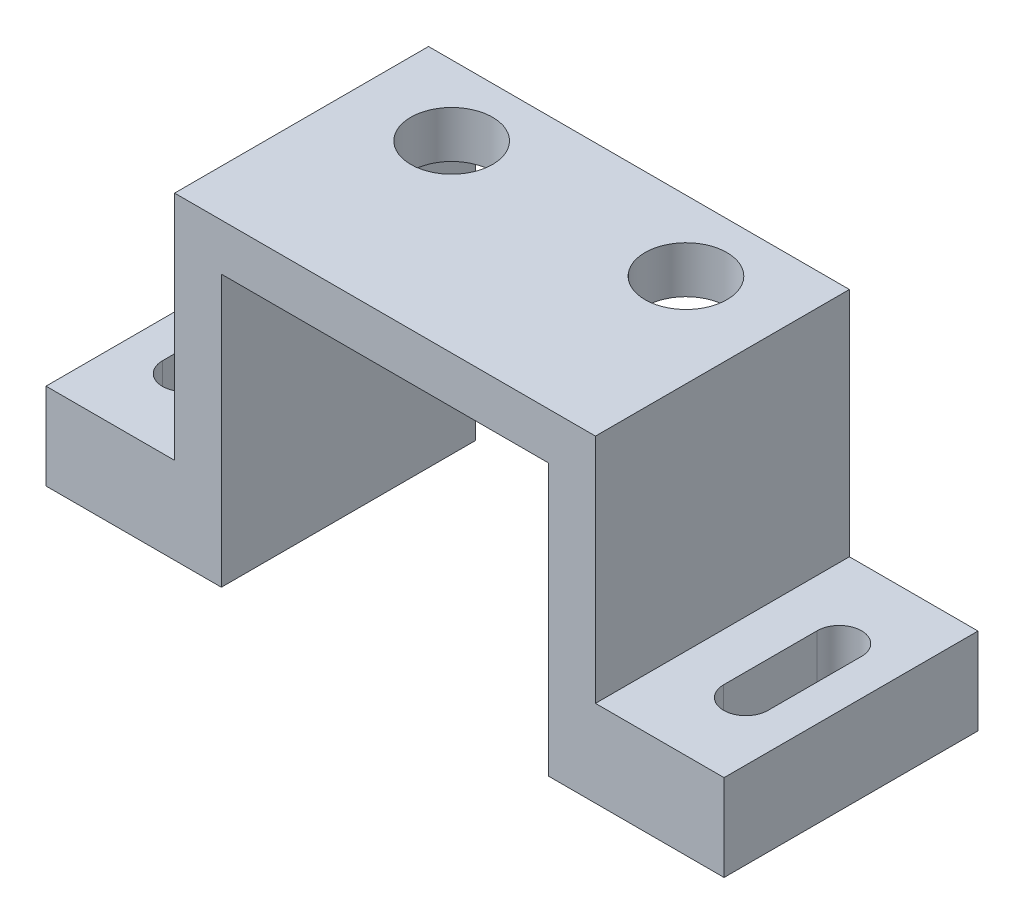
ISO-10303-21;
HEADER;
FILE_DESCRIPTION(('STEP AP214'),'2;1');
FILE_NAME('part.step','',(''),(''),'','','');
FILE_SCHEMA(('AUTOMOTIVE_DESIGN { 1 0 10303 214 1 1 1 1 }'));
ENDSEC;
DATA;
#1=APPLICATION_CONTEXT('core data for automotive mechanical design processes');
#2=APPLICATION_PROTOCOL_DEFINITION('international standard','automotive_design',2000,#1);
#3=PRODUCT_CONTEXT('',#1,'mechanical');
#4=PRODUCT('Part','Part','',(#3));
#5=PRODUCT_RELATED_PRODUCT_CATEGORY('part','',(#4));
#6=PRODUCT_DEFINITION_FORMATION('','',#4);
#7=PRODUCT_DEFINITION_CONTEXT('part definition',#1,'design');
#8=PRODUCT_DEFINITION('design','',#6,#7);
#9=PRODUCT_DEFINITION_SHAPE('','',#8);
#10=(LENGTH_UNIT() NAMED_UNIT(*) SI_UNIT(.MILLI.,.METRE.));
#11=(NAMED_UNIT(*) PLANE_ANGLE_UNIT() SI_UNIT($,.RADIAN.));
#12=(NAMED_UNIT(*) SI_UNIT($,.STERADIAN.) SOLID_ANGLE_UNIT());
#13=UNCERTAINTY_MEASURE_WITH_UNIT(LENGTH_MEASURE(1.E-05),#10,'distance_accuracy_value','');
#14=(GEOMETRIC_REPRESENTATION_CONTEXT(3) GLOBAL_UNCERTAINTY_ASSIGNED_CONTEXT((#13)) GLOBAL_UNIT_ASSIGNED_CONTEXT((#10,
#11,#12)) REPRESENTATION_CONTEXT('',''));
#15=CARTESIAN_POINT('',(0.,0.,0.));
#16=DIRECTION('',(0.,0.,1.));
#17=DIRECTION('',(1.,0.,0.));
#18=AXIS2_PLACEMENT_3D('',#15,#16,#17);
#19=CARTESIAN_POINT('',(0.,-11.6,0.));
#20=DIRECTION('',(0.,-1.,0.));
#21=DIRECTION('',(0.,0.,-1.));
#22=AXIS2_PLACEMENT_3D('',#19,#20,#21);
#23=PLANE('',#22);
#24=DIRECTION('',(-1.,0.,0.));
#25=VECTOR('',#24,1.);
#26=CARTESIAN_POINT('',(9.,-11.6,-3.));
#27=LINE('',#26,#25);
#28=CARTESIAN_POINT('',(14.5,-11.6,-3.));
#29=VERTEX_POINT('',#28);
#30=CARTESIAN_POINT('',(7.,-11.6,-3.));
#31=VERTEX_POINT('',#30);
#32=EDGE_CURVE('E228',#29,#31,#27,.T.);
#33=ORIENTED_EDGE('',*,*,#32,.F.);
#34=DIRECTION('',(0.,0.,1.));
#35=VECTOR('',#34,1.);
#36=CARTESIAN_POINT('',(14.5,-11.6,-3.));
#37=LINE('',#36,#35);
#38=CARTESIAN_POINT('',(14.5,-11.6,7.86));
#39=VERTEX_POINT('',#38);
#40=EDGE_CURVE('E213',#29,#39,#37,.T.);
#41=ORIENTED_EDGE('',*,*,#40,.T.);
#42=DIRECTION('',(1.,0.,0.));
#43=VECTOR('',#42,1.);
#44=CARTESIAN_POINT('',(9.,-11.6,7.86));
#45=LINE('',#44,#43);
#46=CARTESIAN_POINT('',(7.,-11.6,7.86));
#47=VERTEX_POINT('',#46);
#48=EDGE_CURVE('E223',#47,#39,#45,.T.);
#49=ORIENTED_EDGE('',*,*,#48,.F.);
#50=DIRECTION('',(0.,0.,1.));
#51=VECTOR('',#50,1.);
#52=CARTESIAN_POINT('',(7.,-11.6,7.86));
#53=LINE('',#52,#51);
#54=EDGE_CURVE('E225',#31,#47,#53,.T.);
#55=ORIENTED_EDGE('',*,*,#54,.F.);
#56=EDGE_LOOP('',(#33,#41,#49,#55));
#57=FACE_BOUND('',#56,.T.);
#58=DIRECTION('',(0.,0.,1.));
#59=VECTOR('',#58,1.);
#60=CARTESIAN_POINT('',(12.95,-11.6,0.43));
#61=LINE('',#60,#59);
#62=CARTESIAN_POINT('',(12.95,-11.6,0.43));
#63=VERTEX_POINT('',#62);
#64=CARTESIAN_POINT('',(12.95,-11.6,4.43));
#65=VERTEX_POINT('',#64);
#66=EDGE_CURVE('E182',#63,#65,#61,.T.);
#67=ORIENTED_EDGE('',*,*,#66,.F.);
#68=CARTESIAN_POINT('',(12.,-11.6,0.43));
#69=DIRECTION('',(0.,-1.,0.));
#70=DIRECTION('',(0.,0.,1.));
#71=AXIS2_PLACEMENT_3D('',#68,#69,#70);
#72=CIRCLE('',#71,0.95);
#73=CARTESIAN_POINT('',(11.05,-11.6,0.43));
#74=VERTEX_POINT('',#73);
#75=EDGE_CURVE('E178',#74,#63,#72,.T.);
#76=ORIENTED_EDGE('',*,*,#75,.F.);
#77=DIRECTION('',(0.,0.,-1.));
#78=VECTOR('',#77,1.);
#79=CARTESIAN_POINT('',(11.05,-11.6,0.43));
#80=LINE('',#79,#78);
#81=CARTESIAN_POINT('',(11.05,-11.6,4.43));
#82=VERTEX_POINT('',#81);
#83=EDGE_CURVE('E170',#82,#74,#80,.T.);
#84=ORIENTED_EDGE('',*,*,#83,.F.);
#85=CARTESIAN_POINT('',(12.,-11.6,4.43));
#86=DIRECTION('',(0.,-1.,0.));
#87=DIRECTION('',(0.,0.,1.));
#88=AXIS2_PLACEMENT_3D('',#85,#86,#87);
#89=CIRCLE('',#88,0.950000000000001);
#90=EDGE_CURVE('E177',#65,#82,#89,.T.);
#91=ORIENTED_EDGE('',*,*,#90,.F.);
#92=EDGE_LOOP('',(#67,#76,#84,#91));
#93=FACE_BOUND('',#92,.T.);
#94=ADVANCED_FACE('F33',(#57,#93),#23,.T.);
#95=CARTESIAN_POINT('',(14.5,-7.9,-3.));
#96=DIRECTION('',(0.,1.,0.));
#97=DIRECTION('',(0.,0.,1.));
#98=AXIS2_PLACEMENT_3D('',#95,#96,#97);
#99=PLANE('',#98);
#100=DIRECTION('',(0.,0.,-1.));
#101=VECTOR('',#100,1.);
#102=CARTESIAN_POINT('',(9.,-7.9,-3.));
#103=LINE('',#102,#101);
#104=CARTESIAN_POINT('',(9.,-7.9,7.86));
#105=VERTEX_POINT('',#104);
#106=CARTESIAN_POINT('',(9.,-7.9,-3.));
#107=VERTEX_POINT('',#106);
#108=EDGE_CURVE('E200',#105,#107,#103,.T.);
#109=ORIENTED_EDGE('',*,*,#108,.F.);
#110=DIRECTION('',(-1.,0.,0.));
#111=VECTOR('',#110,1.);
#112=CARTESIAN_POINT('',(14.5,-7.9,7.86));
#113=LINE('',#112,#111);
#114=CARTESIAN_POINT('',(14.5,-7.9,7.86));
#115=VERTEX_POINT('',#114);
#116=EDGE_CURVE('E216',#115,#105,#113,.T.);
#117=ORIENTED_EDGE('',*,*,#116,.F.);
#118=DIRECTION('',(0.,0.,-1.));
#119=VECTOR('',#118,1.);
#120=CARTESIAN_POINT('',(14.5,-7.9,-3.));
#121=LINE('',#120,#119);
#122=CARTESIAN_POINT('',(14.5,-7.9,-3.));
#123=VERTEX_POINT('',#122);
#124=EDGE_CURVE('E207',#115,#123,#121,.T.);
#125=ORIENTED_EDGE('',*,*,#124,.T.);
#126=DIRECTION('',(-1.,0.,0.));
#127=VECTOR('',#126,1.);
#128=CARTESIAN_POINT('',(14.5,-7.9,-3.));
#129=LINE('',#128,#127);
#130=EDGE_CURVE('E220',#123,#107,#129,.T.);
#131=ORIENTED_EDGE('',*,*,#130,.T.);
#132=EDGE_LOOP('',(#109,#117,#125,#131));
#133=FACE_BOUND('',#132,.T.);
#134=DIRECTION('',(0.,0.,-1.));
#135=VECTOR('',#134,1.);
#136=CARTESIAN_POINT('',(11.05,-7.9,0.43));
#137=LINE('',#136,#135);
#138=CARTESIAN_POINT('',(11.05,-7.9,4.43));
#139=VERTEX_POINT('',#138);
#140=CARTESIAN_POINT('',(11.05,-7.9,0.430000000000001));
#141=VERTEX_POINT('',#140);
#142=EDGE_CURVE('E194',#139,#141,#137,.T.);
#143=ORIENTED_EDGE('',*,*,#142,.T.);
#144=CARTESIAN_POINT('',(12.,-7.9,0.43));
#145=DIRECTION('',(0.,-1.,0.));
#146=DIRECTION('',(0.,0.,1.));
#147=AXIS2_PLACEMENT_3D('',#144,#145,#146);
#148=CIRCLE('',#147,0.95);
#149=CARTESIAN_POINT('',(12.95,-7.9,0.43));
#150=VERTEX_POINT('',#149);
#151=EDGE_CURVE('E56',#141,#150,#148,.T.);
#152=ORIENTED_EDGE('',*,*,#151,.T.);
#153=DIRECTION('',(0.,0.,1.));
#154=VECTOR('',#153,1.);
#155=CARTESIAN_POINT('',(12.95,-7.9,0.43));
#156=LINE('',#155,#154);
#157=CARTESIAN_POINT('',(12.95,-7.9,4.43));
#158=VERTEX_POINT('',#157);
#159=EDGE_CURVE('E185',#150,#158,#156,.T.);
#160=ORIENTED_EDGE('',*,*,#159,.T.);
#161=CARTESIAN_POINT('',(12.,-7.9,4.43));
#162=DIRECTION('',(0.,-1.,0.));
#163=DIRECTION('',(0.,0.,1.));
#164=AXIS2_PLACEMENT_3D('',#161,#162,#163);
#165=CIRCLE('',#164,0.950000000000001);
#166=EDGE_CURVE('E188',#158,#139,#165,.T.);
#167=ORIENTED_EDGE('',*,*,#166,.T.);
#168=EDGE_LOOP('',(#143,#152,#160,#167));
#169=FACE_BOUND('',#168,.T.);
#170=ADVANCED_FACE('F363',(#133,#169),#99,.T.);
#171=CARTESIAN_POINT('',(-9.,2.,3.));
#172=DIRECTION('',(1.,0.,0.));
#173=DIRECTION('',(0.,0.,-1.));
#174=AXIS2_PLACEMENT_3D('',#171,#172,#173);
#175=PLANE('',#174);
#176=DIRECTION('',(0.,-1.,0.));
#177=VECTOR('',#176,1.);
#178=CARTESIAN_POINT('',(-9.,20.6445595281841,7.86));
#179=LINE('',#178,#177);
#180=CARTESIAN_POINT('',(-9.,2.,7.86));
#181=VERTEX_POINT('',#180);
#182=CARTESIAN_POINT('',(-9.,-7.9,7.86));
#183=VERTEX_POINT('',#182);
#184=EDGE_CURVE('E307',#181,#183,#179,.T.);
#185=ORIENTED_EDGE('',*,*,#184,.F.);
#186=DIRECTION('',(0.,0.,1.));
#187=VECTOR('',#186,1.);
#188=CARTESIAN_POINT('',(-9.,2.,3.));
#189=LINE('',#188,#187);
#190=CARTESIAN_POINT('',(-9.,2.,-3.));
#191=VERTEX_POINT('',#190);
#192=EDGE_CURVE('E330',#191,#181,#189,.T.);
#193=ORIENTED_EDGE('',*,*,#192,.F.);
#194=DIRECTION('',(0.,-1.,0.));
#195=VECTOR('',#194,1.);
#196=CARTESIAN_POINT('',(-9.,2.,-3.));
#197=LINE('',#196,#195);
#198=CARTESIAN_POINT('',(-9.,-7.9,-3.));
#199=VERTEX_POINT('',#198);
#200=EDGE_CURVE('E41',#191,#199,#197,.T.);
#201=ORIENTED_EDGE('',*,*,#200,.T.);
#202=DIRECTION('',(0.,0.,-1.));
#203=VECTOR('',#202,1.);
#204=CARTESIAN_POINT('',(-9.,-7.9,-3.));
#205=LINE('',#204,#203);
#206=EDGE_CURVE('E263',#183,#199,#205,.T.);
#207=ORIENTED_EDGE('',*,*,#206,.F.);
#208=EDGE_LOOP('',(#185,#193,#201,#207));
#209=FACE_BOUND('',#208,.T.);
#210=ADVANCED_FACE('F337',(#209),#175,.F.);
#211=CARTESIAN_POINT('',(9.,2.,3.));
#212=DIRECTION('',(-1.,0.,0.));
#213=DIRECTION('',(0.,0.,1.));
#214=AXIS2_PLACEMENT_3D('',#211,#212,#213);
#215=PLANE('',#214);
#216=DIRECTION('',(0.,-1.,0.));
#217=VECTOR('',#216,1.);
#218=CARTESIAN_POINT('',(9.00000000000001,20.6445595281841,7.86));
#219=LINE('',#218,#217);
#220=CARTESIAN_POINT('',(9.00000000000001,2.,7.86));
#221=VERTEX_POINT('',#220);
#222=EDGE_CURVE('E310',#221,#105,#219,.T.);
#223=ORIENTED_EDGE('',*,*,#222,.T.);
#224=ORIENTED_EDGE('',*,*,#108,.T.);
#225=DIRECTION('',(0.,-1.,0.));
#226=VECTOR('',#225,1.);
#227=CARTESIAN_POINT('',(9.,2.,-3.));
#228=LINE('',#227,#226);
#229=CARTESIAN_POINT('',(9.,2.,-3.));
#230=VERTEX_POINT('',#229);
#231=EDGE_CURVE('E11',#230,#107,#228,.T.);
#232=ORIENTED_EDGE('',*,*,#231,.F.);
#233=DIRECTION('',(0.,0.,-1.));
#234=VECTOR('',#233,1.);
#235=CARTESIAN_POINT('',(9.,2.,3.));
#236=LINE('',#235,#234);
#237=EDGE_CURVE('E326',#221,#230,#236,.T.);
#238=ORIENTED_EDGE('',*,*,#237,.F.);
#239=EDGE_LOOP('',(#223,#224,#232,#238));
#240=FACE_BOUND('',#239,.T.);
#241=ADVANCED_FACE('F35',(#240),#215,.F.);
#242=CARTESIAN_POINT('',(-9.,2.,-3.));
#243=DIRECTION('',(0.,0.,1.));
#244=DIRECTION('',(1.,0.,0.));
#245=AXIS2_PLACEMENT_3D('',#242,#243,#244);
#246=PLANE('',#245);
#247=ORIENTED_EDGE('',*,*,#231,.T.);
#248=ORIENTED_EDGE('',*,*,#130,.F.);
#249=DIRECTION('',(0.,-1.,0.));
#250=VECTOR('',#249,1.);
#251=CARTESIAN_POINT('',(14.5,-11.6,-3.));
#252=LINE('',#251,#250);
#253=EDGE_CURVE('E204',#123,#29,#252,.T.);
#254=ORIENTED_EDGE('',*,*,#253,.T.);
#255=ORIENTED_EDGE('',*,*,#32,.T.);
#256=DIRECTION('',(0.,1.,0.));
#257=VECTOR('',#256,1.);
#258=CARTESIAN_POINT('',(7.,-11.6,-3.));
#259=LINE('',#258,#257);
#260=CARTESIAN_POINT('',(7.,0.,-3.));
#261=VERTEX_POINT('',#260);
#262=EDGE_CURVE('E231',#31,#261,#259,.T.);
#263=ORIENTED_EDGE('',*,*,#262,.T.);
#264=DIRECTION('',(-1.,0.,0.));
#265=VECTOR('',#264,1.);
#266=CARTESIAN_POINT('',(-9.,0.,-3.));
#267=LINE('',#266,#265);
#268=CARTESIAN_POINT('',(-7.,0.,-3.));
#269=VERTEX_POINT('',#268);
#270=EDGE_CURVE('E317',#261,#269,#267,.T.);
#271=ORIENTED_EDGE('',*,*,#270,.T.);
#272=DIRECTION('',(0.,1.,0.));
#273=VECTOR('',#272,1.);
#274=CARTESIAN_POINT('',(-7.,-11.6,-3.));
#275=LINE('',#274,#273);
#276=CARTESIAN_POINT('',(-7.,-11.6,-3.));
#277=VERTEX_POINT('',#276);
#278=EDGE_CURVE('E299',#277,#269,#275,.T.);
#279=ORIENTED_EDGE('',*,*,#278,.F.);
#280=DIRECTION('',(1.,0.,0.));
#281=VECTOR('',#280,1.);
#282=CARTESIAN_POINT('',(-9.,-11.6,-3.));
#283=LINE('',#282,#281);
#284=CARTESIAN_POINT('',(-14.5,-11.6,-3.));
#285=VERTEX_POINT('',#284);
#286=EDGE_CURVE('E289',#285,#277,#283,.T.);
#287=ORIENTED_EDGE('',*,*,#286,.F.);
#288=DIRECTION('',(0.,-1.,0.));
#289=VECTOR('',#288,1.);
#290=CARTESIAN_POINT('',(-14.5,-11.6,-3.));
#291=LINE('',#290,#289);
#292=CARTESIAN_POINT('',(-14.5,-7.9,-3.));
#293=VERTEX_POINT('',#292);
#294=EDGE_CURVE('E270',#293,#285,#291,.T.);
#295=ORIENTED_EDGE('',*,*,#294,.F.);
#296=DIRECTION('',(1.,0.,0.));
#297=VECTOR('',#296,1.);
#298=CARTESIAN_POINT('',(-14.5,-7.9,-3.));
#299=LINE('',#298,#297);
#300=EDGE_CURVE('E280',#293,#199,#299,.T.);
#301=ORIENTED_EDGE('',*,*,#300,.T.);
#302=ORIENTED_EDGE('',*,*,#200,.F.);
#303=DIRECTION('',(-1.,0.,0.));
#304=VECTOR('',#303,1.);
#305=CARTESIAN_POINT('',(-9.,2.,-3.));
#306=LINE('',#305,#304);
#307=EDGE_CURVE('E328',#230,#191,#306,.T.);
#308=ORIENTED_EDGE('',*,*,#307,.F.);
#309=EDGE_LOOP('',(#247,#248,#254,#255,#263,#271,#279,#287,#295,#301,#302,#308));
#310=FACE_BOUND('',#309,.T.);
#311=ADVANCED_FACE('F346',(#310),#246,.F.);
#312=CARTESIAN_POINT('',(0.,2.,0.));
#313=DIRECTION('',(0.,-1.,0.));
#314=DIRECTION('',(0.,0.,-1.));
#315=AXIS2_PLACEMENT_3D('',#312,#313,#314);
#316=PLANE('',#315);
#317=CARTESIAN_POINT('',(-5.01,2.,0.));
#318=DIRECTION('',(0.,1.,0.));
#319=DIRECTION('',(0.,0.,1.));
#320=AXIS2_PLACEMENT_3D('',#317,#318,#319);
#321=CIRCLE('',#320,1.75);
#322=CARTESIAN_POINT('',(-5.01,2.,1.75));
#323=VERTEX_POINT('',#322);
#324=EDGE_CURVE('E318',#323,#323,#321,.T.);
#325=ORIENTED_EDGE('',*,*,#324,.F.);
#326=EDGE_LOOP('',(#325));
#327=FACE_BOUND('',#326,.T.);
#328=CARTESIAN_POINT('',(5.01,2.,0.));
#329=DIRECTION('',(0.,1.,0.));
#330=DIRECTION('',(0.,0.,1.));
#331=AXIS2_PLACEMENT_3D('',#328,#329,#330);
#332=CIRCLE('',#331,1.75);
#333=CARTESIAN_POINT('',(5.01,2.,1.75));
#334=VERTEX_POINT('',#333);
#335=EDGE_CURVE('E306',#334,#334,#332,.T.);
#336=ORIENTED_EDGE('',*,*,#335,.F.);
#337=EDGE_LOOP('',(#336));
#338=FACE_BOUND('',#337,.T.);
#339=ORIENTED_EDGE('',*,*,#192,.T.);
#340=DIRECTION('',(-1.,0.,0.));
#341=VECTOR('',#340,1.);
#342=CARTESIAN_POINT('',(-9.,2.,7.86));
#343=LINE('',#342,#341);
#344=EDGE_CURVE('E303',#221,#181,#343,.T.);
#345=ORIENTED_EDGE('',*,*,#344,.F.);
#346=ORIENTED_EDGE('',*,*,#237,.T.);
#347=ORIENTED_EDGE('',*,*,#307,.T.);
#348=EDGE_LOOP('',(#339,#345,#346,#347));
#349=FACE_BOUND('',#348,.T.);
#350=ADVANCED_FACE('F358',(#327,#338,#349),#316,.F.);
#351=CARTESIAN_POINT('',(0.,0.,0.));
#352=DIRECTION('',(0.,-1.,0.));
#353=DIRECTION('',(0.,0.,-1.));
#354=AXIS2_PLACEMENT_3D('',#351,#352,#353);
#355=PLANE('',#354);
#356=DIRECTION('',(0.,0.,1.));
#357=VECTOR('',#356,1.);
#358=CARTESIAN_POINT('',(7.,0.,7.86));
#359=LINE('',#358,#357);
#360=CARTESIAN_POINT('',(7.,0.,7.86));
#361=VERTEX_POINT('',#360);
#362=EDGE_CURVE('E222',#261,#361,#359,.T.);
#363=ORIENTED_EDGE('',*,*,#362,.T.);
#364=DIRECTION('',(1.,0.,0.));
#365=VECTOR('',#364,1.);
#366=CARTESIAN_POINT('',(-9.,0.,7.86));
#367=LINE('',#366,#365);
#368=CARTESIAN_POINT('',(-7.,0.,7.86));
#369=VERTEX_POINT('',#368);
#370=EDGE_CURVE('E302',#369,#361,#367,.T.);
#371=ORIENTED_EDGE('',*,*,#370,.F.);
#372=DIRECTION('',(0.,0.,1.));
#373=VECTOR('',#372,1.);
#374=CARTESIAN_POINT('',(-7.,0.,7.86));
#375=LINE('',#374,#373);
#376=EDGE_CURVE('E288',#269,#369,#375,.T.);
#377=ORIENTED_EDGE('',*,*,#376,.F.);
#378=ORIENTED_EDGE('',*,*,#270,.F.);
#379=EDGE_LOOP('',(#363,#371,#377,#378));
#380=FACE_BOUND('',#379,.T.);
#381=CARTESIAN_POINT('',(-5.01,0.,0.));
#382=DIRECTION('',(0.,1.,0.));
#383=DIRECTION('',(0.,0.,1.));
#384=AXIS2_PLACEMENT_3D('',#381,#382,#383);
#385=CIRCLE('',#384,1.75);
#386=CARTESIAN_POINT('',(-5.01,0.,1.75));
#387=VERTEX_POINT('',#386);
#388=EDGE_CURVE('E314',#387,#387,#385,.T.);
#389=ORIENTED_EDGE('',*,*,#388,.T.);
#390=EDGE_LOOP('',(#389));
#391=FACE_BOUND('',#390,.T.);
#392=CARTESIAN_POINT('',(5.01,0.,0.));
#393=DIRECTION('',(0.,1.,0.));
#394=DIRECTION('',(0.,0.,1.));
#395=AXIS2_PLACEMENT_3D('',#392,#393,#394);
#396=CIRCLE('',#395,1.75);
#397=CARTESIAN_POINT('',(5.01,0.,1.75));
#398=VERTEX_POINT('',#397);
#399=EDGE_CURVE('E321',#398,#398,#396,.T.);
#400=ORIENTED_EDGE('',*,*,#399,.T.);
#401=EDGE_LOOP('',(#400));
#402=FACE_BOUND('',#401,.T.);
#403=ADVANCED_FACE('F381',(#380,#391,#402),#355,.T.);
#404=CARTESIAN_POINT('',(5.01,0.,0.));
#405=DIRECTION('',(0.,1.,0.));
#406=DIRECTION('',(0.,0.,1.));
#407=AXIS2_PLACEMENT_3D('',#404,#405,#406);
#408=CYLINDRICAL_SURFACE('',#407,1.75);
#409=ORIENTED_EDGE('',*,*,#399,.F.);
#410=EDGE_LOOP('',(#409));
#411=FACE_BOUND('',#410,.T.);
#412=ORIENTED_EDGE('',*,*,#335,.T.);
#413=EDGE_LOOP('',(#412));
#414=FACE_BOUND('',#413,.T.);
#415=ADVANCED_FACE('F550',(#411,#414),#408,.F.);
#416=CARTESIAN_POINT('',(-5.01,0.,0.));
#417=DIRECTION('',(0.,1.,0.));
#418=DIRECTION('',(0.,0.,1.));
#419=AXIS2_PLACEMENT_3D('',#416,#417,#418);
#420=CYLINDRICAL_SURFACE('',#419,1.75);
#421=ORIENTED_EDGE('',*,*,#388,.F.);
#422=EDGE_LOOP('',(#421));
#423=FACE_BOUND('',#422,.T.);
#424=ORIENTED_EDGE('',*,*,#324,.T.);
#425=EDGE_LOOP('',(#424));
#426=FACE_BOUND('',#425,.T.);
#427=ADVANCED_FACE('F560',(#423,#426),#420,.F.);
#428=CARTESIAN_POINT('',(-9.,20.6445595281841,7.86));
#429=DIRECTION('',(0.,0.,-1.));
#430=DIRECTION('',(-1.,0.,0.));
#431=AXIS2_PLACEMENT_3D('',#428,#429,#430);
#432=PLANE('',#431);
#433=ORIENTED_EDGE('',*,*,#184,.T.);
#434=DIRECTION('',(1.,0.,0.));
#435=VECTOR('',#434,1.);
#436=CARTESIAN_POINT('',(-14.5,-7.9,7.86));
#437=LINE('',#436,#435);
#438=CARTESIAN_POINT('',(-14.5,-7.9,7.86));
#439=VERTEX_POINT('',#438);
#440=EDGE_CURVE('E285',#439,#183,#437,.T.);
#441=ORIENTED_EDGE('',*,*,#440,.F.);
#442=DIRECTION('',(0.,1.,0.));
#443=VECTOR('',#442,1.);
#444=CARTESIAN_POINT('',(-14.5,-11.6,7.86));
#445=LINE('',#444,#443);
#446=CARTESIAN_POINT('',(-14.5,-11.6,7.86));
#447=VERTEX_POINT('',#446);
#448=EDGE_CURVE('E276',#447,#439,#445,.T.);
#449=ORIENTED_EDGE('',*,*,#448,.F.);
#450=DIRECTION('',(-1.,0.,0.));
#451=VECTOR('',#450,1.);
#452=CARTESIAN_POINT('',(-9.,-11.6,7.86));
#453=LINE('',#452,#451);
#454=CARTESIAN_POINT('',(-7.,-11.6,7.86));
#455=VERTEX_POINT('',#454);
#456=EDGE_CURVE('E293',#455,#447,#453,.T.);
#457=ORIENTED_EDGE('',*,*,#456,.F.);
#458=DIRECTION('',(0.,1.,0.));
#459=VECTOR('',#458,1.);
#460=CARTESIAN_POINT('',(-7.,-11.6,7.86));
#461=LINE('',#460,#459);
#462=EDGE_CURVE('E295',#455,#369,#461,.T.);
#463=ORIENTED_EDGE('',*,*,#462,.T.);
#464=ORIENTED_EDGE('',*,*,#370,.T.);
#465=DIRECTION('',(0.,1.,0.));
#466=VECTOR('',#465,1.);
#467=CARTESIAN_POINT('',(7.,-11.6,7.86));
#468=LINE('',#467,#466);
#469=EDGE_CURVE('E235',#47,#361,#468,.T.);
#470=ORIENTED_EDGE('',*,*,#469,.F.);
#471=ORIENTED_EDGE('',*,*,#48,.T.);
#472=DIRECTION('',(0.,1.,0.));
#473=VECTOR('',#472,1.);
#474=CARTESIAN_POINT('',(14.5,-11.6,7.86));
#475=LINE('',#474,#473);
#476=EDGE_CURVE('E210',#39,#115,#475,.T.);
#477=ORIENTED_EDGE('',*,*,#476,.T.);
#478=ORIENTED_EDGE('',*,*,#116,.T.);
#479=ORIENTED_EDGE('',*,*,#222,.F.);
#480=ORIENTED_EDGE('',*,*,#344,.T.);
#481=EDGE_LOOP('',(#433,#441,#449,#457,#463,#464,#470,#471,#477,#478,#479,#480));
#482=FACE_BOUND('',#481,.T.);
#483=ADVANCED_FACE('F354',(#482),#432,.F.);
#484=CARTESIAN_POINT('',(-7.,-11.6,7.86));
#485=DIRECTION('',(-1.,0.,0.));
#486=DIRECTION('',(0.,0.,1.));
#487=AXIS2_PLACEMENT_3D('',#484,#485,#486);
#488=PLANE('',#487);
#489=ORIENTED_EDGE('',*,*,#376,.T.);
#490=ORIENTED_EDGE('',*,*,#462,.F.);
#491=DIRECTION('',(0.,0.,1.));
#492=VECTOR('',#491,1.);
#493=CARTESIAN_POINT('',(-7.,-11.6,7.86));
#494=LINE('',#493,#492);
#495=EDGE_CURVE('E291',#277,#455,#494,.T.);
#496=ORIENTED_EDGE('',*,*,#495,.F.);
#497=ORIENTED_EDGE('',*,*,#278,.T.);
#498=EDGE_LOOP('',(#489,#490,#496,#497));
#499=FACE_BOUND('',#498,.T.);
#500=ADVANCED_FACE('F386',(#499),#488,.F.);
#501=CARTESIAN_POINT('',(0.,-11.6,0.));
#502=DIRECTION('',(0.,-1.,0.));
#503=DIRECTION('',(0.,0.,-1.));
#504=AXIS2_PLACEMENT_3D('',#501,#502,#503);
#505=PLANE('',#504);
#506=CARTESIAN_POINT('',(-12.,-11.6,0.43));
#507=DIRECTION('',(0.,1.,0.));
#508=DIRECTION('',(0.,0.,1.));
#509=AXIS2_PLACEMENT_3D('',#506,#507,#508);
#510=CIRCLE('',#509,0.95);
#511=CARTESIAN_POINT('',(-11.05,-11.6,0.43));
#512=VERTEX_POINT('',#511);
#513=CARTESIAN_POINT('',(-12.95,-11.6,0.43));
#514=VERTEX_POINT('',#513);
#515=EDGE_CURVE('E238',#512,#514,#510,.T.);
#516=ORIENTED_EDGE('',*,*,#515,.T.);
#517=DIRECTION('',(0.,0.,1.));
#518=VECTOR('',#517,1.);
#519=CARTESIAN_POINT('',(-12.95,-11.6,0.43));
#520=LINE('',#519,#518);
#521=CARTESIAN_POINT('',(-12.95,-11.6,4.43));
#522=VERTEX_POINT('',#521);
#523=EDGE_CURVE('E241',#514,#522,#520,.T.);
#524=ORIENTED_EDGE('',*,*,#523,.T.);
#525=CARTESIAN_POINT('',(-12.,-11.6,4.43));
#526=DIRECTION('',(0.,1.,0.));
#527=DIRECTION('',(0.,0.,1.));
#528=AXIS2_PLACEMENT_3D('',#525,#526,#527);
#529=CIRCLE('',#528,0.950000000000001);
#530=CARTESIAN_POINT('',(-11.05,-11.6,4.43));
#531=VERTEX_POINT('',#530);
#532=EDGE_CURVE('E245',#522,#531,#529,.T.);
#533=ORIENTED_EDGE('',*,*,#532,.T.);
#534=DIRECTION('',(0.,0.,-1.));
#535=VECTOR('',#534,1.);
#536=CARTESIAN_POINT('',(-11.05,-11.6,0.43));
#537=LINE('',#536,#535);
#538=EDGE_CURVE('E248',#531,#512,#537,.T.);
#539=ORIENTED_EDGE('',*,*,#538,.T.);
#540=EDGE_LOOP('',(#516,#524,#533,#539));
#541=FACE_BOUND('',#540,.T.);
#542=ORIENTED_EDGE('',*,*,#456,.T.);
#543=DIRECTION('',(0.,0.,1.));
#544=VECTOR('',#543,1.);
#545=CARTESIAN_POINT('',(-14.5,-11.6,-3.));
#546=LINE('',#545,#544);
#547=EDGE_CURVE('E273',#285,#447,#546,.T.);
#548=ORIENTED_EDGE('',*,*,#547,.F.);
#549=ORIENTED_EDGE('',*,*,#286,.T.);
#550=ORIENTED_EDGE('',*,*,#495,.T.);
#551=EDGE_LOOP('',(#542,#548,#549,#550));
#552=FACE_BOUND('',#551,.T.);
#553=ADVANCED_FACE('F388',(#541,#552),#505,.T.);
#554=CARTESIAN_POINT('',(-14.5,-7.9,-3.));
#555=DIRECTION('',(0.,-1.,0.));
#556=DIRECTION('',(0.,0.,-1.));
#557=AXIS2_PLACEMENT_3D('',#554,#555,#556);
#558=PLANE('',#557);
#559=DIRECTION('',(0.,0.,1.));
#560=VECTOR('',#559,1.);
#561=CARTESIAN_POINT('',(-12.95,-7.9,0.43));
#562=LINE('',#561,#560);
#563=CARTESIAN_POINT('',(-12.95,-7.9,0.430000000000001));
#564=VERTEX_POINT('',#563);
#565=CARTESIAN_POINT('',(-12.95,-7.9,4.43));
#566=VERTEX_POINT('',#565);
#567=EDGE_CURVE('E253',#564,#566,#562,.T.);
#568=ORIENTED_EDGE('',*,*,#567,.F.);
#569=CARTESIAN_POINT('',(-12.,-7.9,0.43));
#570=DIRECTION('',(0.,1.,0.));
#571=DIRECTION('',(0.,0.,1.));
#572=AXIS2_PLACEMENT_3D('',#569,#570,#571);
#573=CIRCLE('',#572,0.95);
#574=CARTESIAN_POINT('',(-11.05,-7.9,0.43));
#575=VERTEX_POINT('',#574);
#576=EDGE_CURVE('E237',#575,#564,#573,.T.);
#577=ORIENTED_EDGE('',*,*,#576,.F.);
#578=DIRECTION('',(0.,0.,-1.));
#579=VECTOR('',#578,1.);
#580=CARTESIAN_POINT('',(-11.05,-7.9,0.43));
#581=LINE('',#580,#579);
#582=CARTESIAN_POINT('',(-11.05,-7.9,4.43));
#583=VERTEX_POINT('',#582);
#584=EDGE_CURVE('E242',#583,#575,#581,.T.);
#585=ORIENTED_EDGE('',*,*,#584,.F.);
#586=CARTESIAN_POINT('',(-12.,-7.9,4.43));
#587=DIRECTION('',(0.,1.,0.));
#588=DIRECTION('',(0.,0.,1.));
#589=AXIS2_PLACEMENT_3D('',#586,#587,#588);
#590=CIRCLE('',#589,0.950000000000001);
#591=EDGE_CURVE('E256',#566,#583,#590,.T.);
#592=ORIENTED_EDGE('',*,*,#591,.F.);
#593=EDGE_LOOP('',(#568,#577,#585,#592));
#594=FACE_BOUND('',#593,.T.);
#595=ORIENTED_EDGE('',*,*,#206,.T.);
#596=ORIENTED_EDGE('',*,*,#300,.F.);
#597=DIRECTION('',(0.,0.,-1.));
#598=VECTOR('',#597,1.);
#599=CARTESIAN_POINT('',(-14.5,-7.9,-3.));
#600=LINE('',#599,#598);
#601=EDGE_CURVE('E278',#439,#293,#600,.T.);
#602=ORIENTED_EDGE('',*,*,#601,.F.);
#603=ORIENTED_EDGE('',*,*,#440,.T.);
#604=EDGE_LOOP('',(#595,#596,#602,#603));
#605=FACE_BOUND('',#604,.T.);
#606=ADVANCED_FACE('F342',(#594,#605),#558,.F.);
#607=CARTESIAN_POINT('',(-14.5,0.,0.));
#608=DIRECTION('',(1.,0.,0.));
#609=DIRECTION('',(0.,0.,-1.));
#610=AXIS2_PLACEMENT_3D('',#607,#608,#609);
#611=PLANE('',#610);
#612=ORIENTED_EDGE('',*,*,#294,.T.);
#613=ORIENTED_EDGE('',*,*,#547,.T.);
#614=ORIENTED_EDGE('',*,*,#448,.T.);
#615=ORIENTED_EDGE('',*,*,#601,.T.);
#616=EDGE_LOOP('',(#612,#613,#614,#615));
#617=FACE_BOUND('',#616,.T.);
#618=ADVANCED_FACE('F350',(#617),#611,.F.);
#619=CARTESIAN_POINT('',(-12.,-11.6,0.43));
#620=DIRECTION('',(0.,1.,0.));
#621=DIRECTION('',(0.,0.,1.));
#622=AXIS2_PLACEMENT_3D('',#619,#620,#621);
#623=CYLINDRICAL_SURFACE('',#622,0.95);
#624=ORIENTED_EDGE('',*,*,#576,.T.);
#625=DIRECTION('',(0.,1.,0.));
#626=VECTOR('',#625,1.);
#627=CARTESIAN_POINT('',(-12.95,-11.6,0.43));
#628=LINE('',#627,#626);
#629=EDGE_CURVE('E251',#514,#564,#628,.T.);
#630=ORIENTED_EDGE('',*,*,#629,.F.);
#631=ORIENTED_EDGE('',*,*,#515,.F.);
#632=DIRECTION('',(0.,1.,0.));
#633=VECTOR('',#632,1.);
#634=CARTESIAN_POINT('',(-11.05,-11.6,0.43));
#635=LINE('',#634,#633);
#636=EDGE_CURVE('E261',#512,#575,#635,.T.);
#637=ORIENTED_EDGE('',*,*,#636,.T.);
#638=EDGE_LOOP('',(#624,#630,#631,#637));
#639=FACE_BOUND('',#638,.T.);
#640=ADVANCED_FACE('F414',(#639),#623,.F.);
#641=CARTESIAN_POINT('',(-11.05,-11.6,0.43));
#642=DIRECTION('',(1.,0.,0.));
#643=DIRECTION('',(0.,0.,-1.));
#644=AXIS2_PLACEMENT_3D('',#641,#642,#643);
#645=PLANE('',#644);
#646=ORIENTED_EDGE('',*,*,#584,.T.);
#647=ORIENTED_EDGE('',*,*,#636,.F.);
#648=ORIENTED_EDGE('',*,*,#538,.F.);
#649=DIRECTION('',(0.,1.,0.));
#650=VECTOR('',#649,1.);
#651=CARTESIAN_POINT('',(-11.05,-11.6,4.43));
#652=LINE('',#651,#650);
#653=EDGE_CURVE('E264',#531,#583,#652,.T.);
#654=ORIENTED_EDGE('',*,*,#653,.T.);
#655=EDGE_LOOP('',(#646,#647,#648,#654));
#656=FACE_BOUND('',#655,.T.);
#657=ADVANCED_FACE('F410',(#656),#645,.F.);
#658=CARTESIAN_POINT('',(-12.,-11.6,4.43));
#659=DIRECTION('',(0.,1.,0.));
#660=DIRECTION('',(0.,0.,1.));
#661=AXIS2_PLACEMENT_3D('',#658,#659,#660);
#662=CYLINDRICAL_SURFACE('',#661,0.950000000000001);
#663=ORIENTED_EDGE('',*,*,#591,.T.);
#664=ORIENTED_EDGE('',*,*,#653,.F.);
#665=ORIENTED_EDGE('',*,*,#532,.F.);
#666=DIRECTION('',(0.,1.,0.));
#667=VECTOR('',#666,1.);
#668=CARTESIAN_POINT('',(-12.95,-11.6,4.43));
#669=LINE('',#668,#667);
#670=EDGE_CURVE('E266',#522,#566,#669,.T.);
#671=ORIENTED_EDGE('',*,*,#670,.T.);
#672=EDGE_LOOP('',(#663,#664,#665,#671));
#673=FACE_BOUND('',#672,.T.);
#674=ADVANCED_FACE('F413',(#673),#662,.F.);
#675=CARTESIAN_POINT('',(-12.95,-11.6,0.43));
#676=DIRECTION('',(-1.,0.,0.));
#677=DIRECTION('',(0.,0.,1.));
#678=AXIS2_PLACEMENT_3D('',#675,#676,#677);
#679=PLANE('',#678);
#680=ORIENTED_EDGE('',*,*,#567,.T.);
#681=ORIENTED_EDGE('',*,*,#670,.F.);
#682=ORIENTED_EDGE('',*,*,#523,.F.);
#683=ORIENTED_EDGE('',*,*,#629,.T.);
#684=EDGE_LOOP('',(#680,#681,#682,#683));
#685=FACE_BOUND('',#684,.T.);
#686=ADVANCED_FACE('F409',(#685),#679,.F.);
#687=CARTESIAN_POINT('',(7.,-11.6,7.86));
#688=DIRECTION('',(-1.,0.,0.));
#689=DIRECTION('',(0.,0.,1.));
#690=AXIS2_PLACEMENT_3D('',#687,#688,#689);
#691=PLANE('',#690);
#692=ORIENTED_EDGE('',*,*,#362,.F.);
#693=ORIENTED_EDGE('',*,*,#262,.F.);
#694=ORIENTED_EDGE('',*,*,#54,.T.);
#695=ORIENTED_EDGE('',*,*,#469,.T.);
#696=EDGE_LOOP('',(#692,#693,#694,#695));
#697=FACE_BOUND('',#696,.T.);
#698=ADVANCED_FACE('F378',(#697),#691,.T.);
#699=CARTESIAN_POINT('',(14.5,0.,0.));
#700=DIRECTION('',(-1.,0.,0.));
#701=DIRECTION('',(0.,0.,-1.));
#702=AXIS2_PLACEMENT_3D('',#699,#700,#701);
#703=PLANE('',#702);
#704=ORIENTED_EDGE('',*,*,#253,.F.);
#705=ORIENTED_EDGE('',*,*,#124,.F.);
#706=ORIENTED_EDGE('',*,*,#476,.F.);
#707=ORIENTED_EDGE('',*,*,#40,.F.);
#708=EDGE_LOOP('',(#704,#705,#706,#707));
#709=FACE_BOUND('',#708,.T.);
#710=ADVANCED_FACE('F369',(#709),#703,.F.);
#711=CARTESIAN_POINT('',(12.,-11.6,0.43));
#712=DIRECTION('',(0.,1.,0.));
#713=DIRECTION('',(0.,0.,1.));
#714=AXIS2_PLACEMENT_3D('',#711,#712,#713);
#715=CYLINDRICAL_SURFACE('',#714,0.95);
#716=ORIENTED_EDGE('',*,*,#151,.F.);
#717=DIRECTION('',(0.,1.,0.));
#718=VECTOR('',#717,1.);
#719=CARTESIAN_POINT('',(11.05,-11.6,0.43));
#720=LINE('',#719,#718);
#721=EDGE_CURVE('E172',#74,#141,#720,.T.);
#722=ORIENTED_EDGE('',*,*,#721,.F.);
#723=ORIENTED_EDGE('',*,*,#75,.T.);
#724=DIRECTION('',(0.,1.,0.));
#725=VECTOR('',#724,1.);
#726=CARTESIAN_POINT('',(12.95,-11.6,0.43));
#727=LINE('',#726,#725);
#728=EDGE_CURVE('E198',#63,#150,#727,.T.);
#729=ORIENTED_EDGE('',*,*,#728,.T.);
#730=EDGE_LOOP('',(#716,#722,#723,#729));
#731=FACE_BOUND('',#730,.T.);
#732=ADVANCED_FACE('F180',(#731),#715,.F.);
#733=CARTESIAN_POINT('',(12.95,-11.6,0.43));
#734=DIRECTION('',(-1.,0.,0.));
#735=DIRECTION('',(0.,0.,1.));
#736=AXIS2_PLACEMENT_3D('',#733,#734,#735);
#737=PLANE('',#736);
#738=ORIENTED_EDGE('',*,*,#159,.F.);
#739=ORIENTED_EDGE('',*,*,#728,.F.);
#740=ORIENTED_EDGE('',*,*,#66,.T.);
#741=DIRECTION('',(0.,1.,0.));
#742=VECTOR('',#741,1.);
#743=CARTESIAN_POINT('',(12.95,-11.6,4.43));
#744=LINE('',#743,#742);
#745=EDGE_CURVE('E201',#65,#158,#744,.T.);
#746=ORIENTED_EDGE('',*,*,#745,.T.);
#747=EDGE_LOOP('',(#738,#739,#740,#746));
#748=FACE_BOUND('',#747,.T.);
#749=ADVANCED_FACE('F463',(#748),#737,.T.);
#750=CARTESIAN_POINT('',(12.,-11.6,4.43));
#751=DIRECTION('',(0.,1.,0.));
#752=DIRECTION('',(0.,0.,1.));
#753=AXIS2_PLACEMENT_3D('',#750,#751,#752);
#754=CYLINDRICAL_SURFACE('',#753,0.950000000000001);
#755=ORIENTED_EDGE('',*,*,#166,.F.);
#756=ORIENTED_EDGE('',*,*,#745,.F.);
#757=ORIENTED_EDGE('',*,*,#90,.T.);
#758=DIRECTION('',(0.,1.,0.));
#759=VECTOR('',#758,1.);
#760=CARTESIAN_POINT('',(11.05,-11.6,4.43));
#761=LINE('',#760,#759);
#762=EDGE_CURVE('E48',#82,#139,#761,.T.);
#763=ORIENTED_EDGE('',*,*,#762,.T.);
#764=EDGE_LOOP('',(#755,#756,#757,#763));
#765=FACE_BOUND('',#764,.T.);
#766=ADVANCED_FACE('F470',(#765),#754,.F.);
#767=CARTESIAN_POINT('',(11.05,-11.6,0.43));
#768=DIRECTION('',(1.,0.,0.));
#769=DIRECTION('',(0.,0.,-1.));
#770=AXIS2_PLACEMENT_3D('',#767,#768,#769);
#771=PLANE('',#770);
#772=ORIENTED_EDGE('',*,*,#142,.F.);
#773=ORIENTED_EDGE('',*,*,#762,.F.);
#774=ORIENTED_EDGE('',*,*,#83,.T.);
#775=ORIENTED_EDGE('',*,*,#721,.T.);
#776=EDGE_LOOP('',(#772,#773,#774,#775));
#777=FACE_BOUND('',#776,.T.);
#778=ADVANCED_FACE('F171',(#777),#771,.T.);
#779=CLOSED_SHELL('',(#94,#170,#210,#241,#311,#350,#403,#415,#427,#483,#500,#553,#606,#618,#640,
#657,#674,#686,#698,#710,#732,#749,#766,#778));
#780=MANIFOLD_SOLID_BREP('B2',#779);
#781=ADVANCED_BREP_SHAPE_REPRESENTATION('',(#18,#780),#14);
#782=SHAPE_DEFINITION_REPRESENTATION(#9,#781);
ENDSEC;
END-ISO-10303-21;
